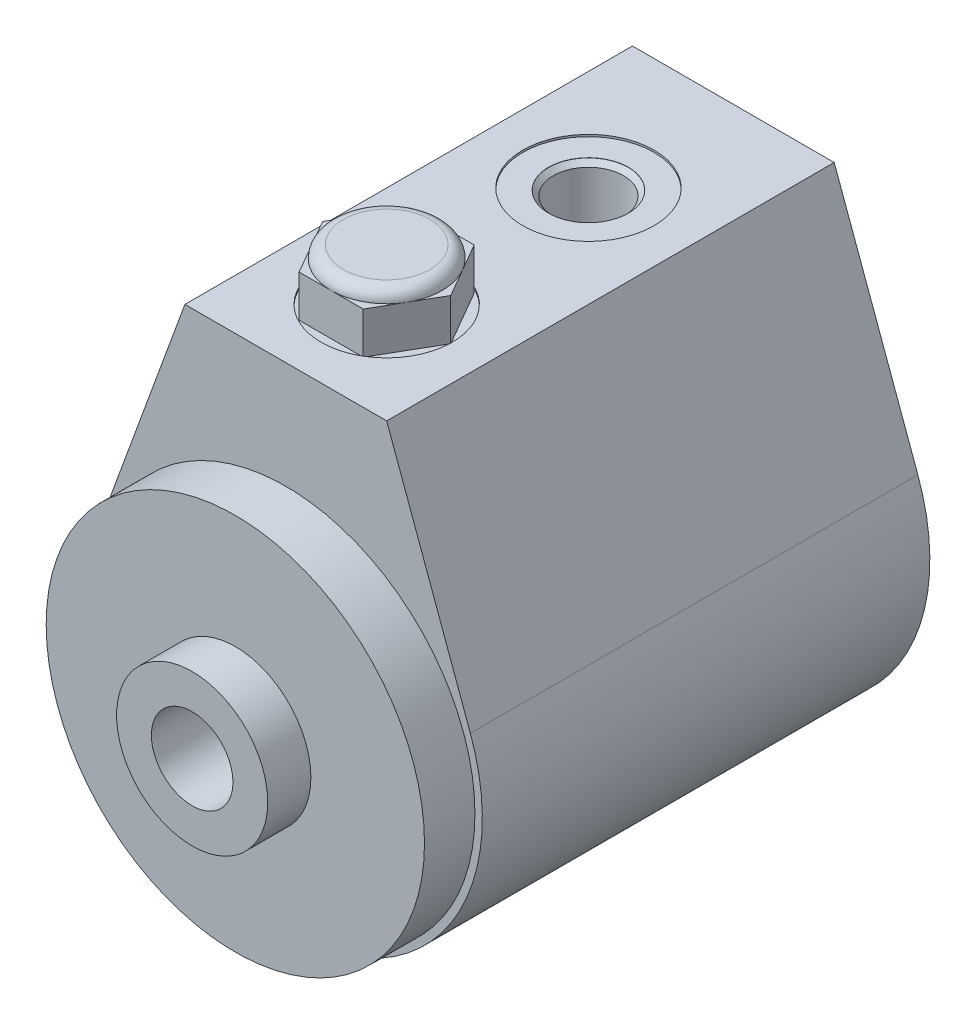
ISO-10303-21;
HEADER;
FILE_DESCRIPTION(('STEP AP214'),'2;1');
FILE_NAME('part.step','',(''),(''),'','','');
FILE_SCHEMA(('AUTOMOTIVE_DESIGN { 1 0 10303 214 1 1 1 1 }'));
ENDSEC;
DATA;
#1=APPLICATION_CONTEXT('core data for automotive mechanical design processes');
#2=APPLICATION_PROTOCOL_DEFINITION('international standard','automotive_design',2000,#1);
#3=PRODUCT_CONTEXT('',#1,'mechanical');
#4=PRODUCT('Part','Part','',(#3));
#5=PRODUCT_RELATED_PRODUCT_CATEGORY('part','',(#4));
#6=PRODUCT_DEFINITION_FORMATION('','',#4);
#7=PRODUCT_DEFINITION_CONTEXT('part definition',#1,'design');
#8=PRODUCT_DEFINITION('design','',#6,#7);
#9=PRODUCT_DEFINITION_SHAPE('','',#8);
#10=(LENGTH_UNIT() NAMED_UNIT(*) SI_UNIT(.MILLI.,.METRE.));
#11=(NAMED_UNIT(*) PLANE_ANGLE_UNIT() SI_UNIT($,.RADIAN.));
#12=(NAMED_UNIT(*) SI_UNIT($,.STERADIAN.) SOLID_ANGLE_UNIT());
#13=UNCERTAINTY_MEASURE_WITH_UNIT(LENGTH_MEASURE(1.E-05),#10,'distance_accuracy_value','');
#14=(GEOMETRIC_REPRESENTATION_CONTEXT(3) GLOBAL_UNCERTAINTY_ASSIGNED_CONTEXT((#13)) GLOBAL_UNIT_ASSIGNED_CONTEXT((#10,
#11,#12)) REPRESENTATION_CONTEXT('',''));
#15=CARTESIAN_POINT('',(0.,0.,0.));
#16=DIRECTION('',(0.,0.,1.));
#17=DIRECTION('',(1.,0.,0.));
#18=AXIS2_PLACEMENT_3D('',#15,#16,#17);
#19=CARTESIAN_POINT('',(4.0327916302895,43.8132,50.6221999999998));
#20=DIRECTION('',(-0.866025403784438,0.,-0.5));
#21=DIRECTION('',(-0.5,0.,0.866025403784438));
#22=AXIS2_PLACEMENT_3D('',#19,#20,#21);
#23=PLANE('',#22);
#24=DIRECTION('',(0.5,0.,-0.866025403784438));
#25=VECTOR('',#24,1.);
#26=CARTESIAN_POINT('',(4.0327916302895,42.2892,50.6221999999998));
#27=LINE('',#26,#25);
#28=CARTESIAN_POINT('',(4.0327916302895,42.2892,50.6221999999998));
#29=VERTEX_POINT('',#28);
#30=CARTESIAN_POINT('',(6.0491874454342,42.2892,47.1296999999999));
#31=VERTEX_POINT('',#30);
#32=EDGE_CURVE('E182',#29,#31,#27,.T.);
#33=ORIENTED_EDGE('',*,*,#32,.F.);
#34=DIRECTION('',(0.,-1.,0.));
#35=VECTOR('',#34,1.);
#36=CARTESIAN_POINT('',(4.0327916302895,43.8132,50.6221999999998));
#37=LINE('',#36,#35);
#38=CARTESIAN_POINT('',(4.0327916302895,37.0332,50.6221999999998));
#39=VERTEX_POINT('',#38);
#40=EDGE_CURVE('E198',#29,#39,#37,.T.);
#41=ORIENTED_EDGE('',*,*,#40,.T.);
#42=DIRECTION('',(0.5,0.,-0.866025403784438));
#43=VECTOR('',#42,1.);
#44=CARTESIAN_POINT('',(4.0327916302895,37.0332,50.6221999999998));
#45=LINE('',#44,#43);
#46=CARTESIAN_POINT('',(8.065583260579,37.0332,43.6371999999999));
#47=VERTEX_POINT('',#46);
#48=EDGE_CURVE('E183',#39,#47,#45,.T.);
#49=ORIENTED_EDGE('',*,*,#48,.T.);
#50=DIRECTION('',(0.,-1.,0.));
#51=VECTOR('',#50,1.);
#52=CARTESIAN_POINT('',(8.065583260579,43.8132,43.6371999999999));
#53=LINE('',#52,#51);
#54=CARTESIAN_POINT('',(8.065583260579,42.2892,43.6371999999999));
#55=VERTEX_POINT('',#54);
#56=EDGE_CURVE('E207',#55,#47,#53,.T.);
#57=ORIENTED_EDGE('',*,*,#56,.F.);
#58=EDGE_CURVE('E180',#31,#55,#27,.T.);
#59=ORIENTED_EDGE('',*,*,#58,.F.);
#60=EDGE_LOOP('',(#33,#41,#49,#57,#59));
#61=FACE_BOUND('',#60,.T.);
#62=ADVANCED_FACE('F42',(#61),#23,.F.);
#63=CARTESIAN_POINT('',(8.065583260579,43.8132,43.6371999999999));
#64=DIRECTION('',(-0.866025403784439,0.,0.5));
#65=DIRECTION('',(0.5,0.,0.866025403784439));
#66=AXIS2_PLACEMENT_3D('',#63,#64,#65);
#67=PLANE('',#66);
#68=DIRECTION('',(-0.5,0.,-0.866025403784439));
#69=VECTOR('',#68,1.);
#70=CARTESIAN_POINT('',(8.065583260579,42.2892,43.6371999999999));
#71=LINE('',#70,#69);
#72=CARTESIAN_POINT('',(6.0491874454343,42.2892,40.1447));
#73=VERTEX_POINT('',#72);
#74=EDGE_CURVE('E179',#55,#73,#71,.T.);
#75=ORIENTED_EDGE('',*,*,#74,.F.);
#76=ORIENTED_EDGE('',*,*,#56,.T.);
#77=DIRECTION('',(-0.5,0.,-0.866025403784439));
#78=VECTOR('',#77,1.);
#79=CARTESIAN_POINT('',(8.065583260579,37.0332,43.6371999999999));
#80=LINE('',#79,#78);
#81=CARTESIAN_POINT('',(4.03279163028937,37.0332,36.6521999999997));
#82=VERTEX_POINT('',#81);
#83=EDGE_CURVE('E186',#47,#82,#80,.T.);
#84=ORIENTED_EDGE('',*,*,#83,.T.);
#85=DIRECTION('',(0.,-1.,0.));
#86=VECTOR('',#85,1.);
#87=CARTESIAN_POINT('',(4.03279163028937,43.8132,36.6521999999997));
#88=LINE('',#87,#86);
#89=CARTESIAN_POINT('',(4.03279163028937,42.2892,36.6521999999997));
#90=VERTEX_POINT('',#89);
#91=EDGE_CURVE('E205',#90,#82,#88,.T.);
#92=ORIENTED_EDGE('',*,*,#91,.F.);
#93=EDGE_CURVE('E148',#73,#90,#71,.T.);
#94=ORIENTED_EDGE('',*,*,#93,.F.);
#95=EDGE_LOOP('',(#75,#76,#84,#92,#94));
#96=FACE_BOUND('',#95,.T.);
#97=ADVANCED_FACE('F343',(#96),#67,.F.);
#98=CARTESIAN_POINT('',(4.03279163028937,43.8132,36.6521999999997));
#99=DIRECTION('',(0.,0.,1.));
#100=DIRECTION('',(1.,0.,0.));
#101=AXIS2_PLACEMENT_3D('',#98,#99,#100);
#102=PLANE('',#101);
#103=DIRECTION('',(-1.,0.,0.));
#104=VECTOR('',#103,1.);
#105=CARTESIAN_POINT('',(4.03279163028937,42.2892,36.6521999999997));
#106=LINE('',#105,#104);
#107=CARTESIAN_POINT('',(0.,42.2892,36.6521999999997));
#108=VERTEX_POINT('',#107);
#109=EDGE_CURVE('E142',#90,#108,#106,.T.);
#110=ORIENTED_EDGE('',*,*,#109,.F.);
#111=ORIENTED_EDGE('',*,*,#91,.T.);
#112=DIRECTION('',(-1.,0.,0.));
#113=VECTOR('',#112,1.);
#114=CARTESIAN_POINT('',(4.03279163028937,37.0332,36.6521999999997));
#115=LINE('',#114,#113);
#116=CARTESIAN_POINT('',(-4.03279163028957,37.0332,36.6521999999997));
#117=VERTEX_POINT('',#116);
#118=EDGE_CURVE('E189',#82,#117,#115,.T.);
#119=ORIENTED_EDGE('',*,*,#118,.T.);
#120=DIRECTION('',(0.,-1.,0.));
#121=VECTOR('',#120,1.);
#122=CARTESIAN_POINT('',(-4.03279163028957,43.8132,36.6521999999997));
#123=LINE('',#122,#121);
#124=CARTESIAN_POINT('',(-4.03279163028957,42.2892,36.6521999999997));
#125=VERTEX_POINT('',#124);
#126=EDGE_CURVE('E173',#125,#117,#123,.T.);
#127=ORIENTED_EDGE('',*,*,#126,.F.);
#128=EDGE_CURVE('E152',#108,#125,#106,.T.);
#129=ORIENTED_EDGE('',*,*,#128,.F.);
#130=EDGE_LOOP('',(#110,#111,#119,#127,#129));
#131=FACE_BOUND('',#130,.T.);
#132=ADVANCED_FACE('F171',(#131),#102,.F.);
#133=CARTESIAN_POINT('',(-4.03279163028957,43.8132,36.6521999999997));
#134=DIRECTION('',(0.866025403784439,0.,0.5));
#135=DIRECTION('',(0.5,0.,-0.866025403784439));
#136=AXIS2_PLACEMENT_3D('',#133,#134,#135);
#137=PLANE('',#136);
#138=DIRECTION('',(-0.5,0.,0.866025403784439));
#139=VECTOR('',#138,1.);
#140=CARTESIAN_POINT('',(-4.03279163028957,42.2892,36.6521999999997));
#141=LINE('',#140,#139);
#142=CARTESIAN_POINT('',(-6.04918744543446,42.2892,40.1446999999999));
#143=VERTEX_POINT('',#142);
#144=EDGE_CURVE('E159',#125,#143,#141,.T.);
#145=ORIENTED_EDGE('',*,*,#144,.F.);
#146=ORIENTED_EDGE('',*,*,#126,.T.);
#147=DIRECTION('',(-0.5,0.,0.866025403784439));
#148=VECTOR('',#147,1.);
#149=CARTESIAN_POINT('',(-4.03279163028957,37.0332,36.6521999999997));
#150=LINE('',#149,#148);
#151=CARTESIAN_POINT('',(-8.06558326057918,37.0332,43.6371999999998));
#152=VERTEX_POINT('',#151);
#153=EDGE_CURVE('E191',#117,#152,#150,.T.);
#154=ORIENTED_EDGE('',*,*,#153,.T.);
#155=DIRECTION('',(0.,-1.,0.));
#156=VECTOR('',#155,1.);
#157=CARTESIAN_POINT('',(-8.06558326057918,43.8132,43.6371999999998));
#158=LINE('',#157,#156);
#159=CARTESIAN_POINT('',(-8.06558326057918,42.2892,43.6371999999998));
#160=VERTEX_POINT('',#159);
#161=EDGE_CURVE('E202',#160,#152,#158,.T.);
#162=ORIENTED_EDGE('',*,*,#161,.F.);
#163=EDGE_CURVE('E174',#143,#160,#141,.T.);
#164=ORIENTED_EDGE('',*,*,#163,.F.);
#165=EDGE_LOOP('',(#145,#146,#154,#162,#164));
#166=FACE_BOUND('',#165,.T.);
#167=ADVANCED_FACE('F363',(#166),#137,.F.);
#168=CARTESIAN_POINT('',(-8.06558326057918,43.8132,43.6371999999998));
#169=DIRECTION('',(0.866025403784439,0.,-0.5));
#170=DIRECTION('',(-0.5,0.,-0.866025403784439));
#171=AXIS2_PLACEMENT_3D('',#168,#169,#170);
#172=PLANE('',#171);
#173=DIRECTION('',(0.5,0.,0.866025403784439));
#174=VECTOR('',#173,1.);
#175=CARTESIAN_POINT('',(-8.06558326057918,42.2892,43.6371999999998));
#176=LINE('',#175,#174);
#177=CARTESIAN_POINT('',(-6.04918744543431,42.2892,47.1297));
#178=VERTEX_POINT('',#177);
#179=EDGE_CURVE('E351',#160,#178,#176,.T.);
#180=ORIENTED_EDGE('',*,*,#179,.F.);
#181=ORIENTED_EDGE('',*,*,#161,.T.);
#182=DIRECTION('',(0.5,0.,0.866025403784439));
#183=VECTOR('',#182,1.);
#184=CARTESIAN_POINT('',(-8.06558326057918,37.0332,43.6371999999998));
#185=LINE('',#184,#183);
#186=CARTESIAN_POINT('',(-4.03279163028966,37.0332,50.6221999999998));
#187=VERTEX_POINT('',#186);
#188=EDGE_CURVE('E194',#152,#187,#185,.T.);
#189=ORIENTED_EDGE('',*,*,#188,.T.);
#190=DIRECTION('',(0.,-1.,0.));
#191=VECTOR('',#190,1.);
#192=CARTESIAN_POINT('',(-4.03279163028966,43.8132,50.6221999999998));
#193=LINE('',#192,#191);
#194=CARTESIAN_POINT('',(-4.03279163028966,42.2892,50.6221999999998));
#195=VERTEX_POINT('',#194);
#196=EDGE_CURVE('E67',#195,#187,#193,.T.);
#197=ORIENTED_EDGE('',*,*,#196,.F.);
#198=EDGE_CURVE('E349',#178,#195,#176,.T.);
#199=ORIENTED_EDGE('',*,*,#198,.F.);
#200=EDGE_LOOP('',(#180,#181,#189,#197,#199));
#201=FACE_BOUND('',#200,.T.);
#202=ADVANCED_FACE('F362',(#201),#172,.F.);
#203=CARTESIAN_POINT('',(-4.03279163028966,43.8132,50.6221999999998));
#204=DIRECTION('',(0.,0.,-1.));
#205=DIRECTION('',(-1.,0.,0.));
#206=AXIS2_PLACEMENT_3D('',#203,#204,#205);
#207=PLANE('',#206);
#208=DIRECTION('',(1.,0.,0.));
#209=VECTOR('',#208,1.);
#210=CARTESIAN_POINT('',(-4.03279163028966,42.2892,50.6221999999998));
#211=LINE('',#210,#209);
#212=CARTESIAN_POINT('',(0.,42.2892,50.6221999999998));
#213=VERTEX_POINT('',#212);
#214=EDGE_CURVE('E11',#195,#213,#211,.T.);
#215=ORIENTED_EDGE('',*,*,#214,.F.);
#216=ORIENTED_EDGE('',*,*,#196,.T.);
#217=DIRECTION('',(1.,0.,0.));
#218=VECTOR('',#217,1.);
#219=CARTESIAN_POINT('',(-4.03279163028966,37.0332,50.6221999999998));
#220=LINE('',#219,#218);
#221=EDGE_CURVE('E196',#187,#39,#220,.T.);
#222=ORIENTED_EDGE('',*,*,#221,.T.);
#223=ORIENTED_EDGE('',*,*,#40,.F.);
#224=EDGE_CURVE('E46',#213,#29,#211,.T.);
#225=ORIENTED_EDGE('',*,*,#224,.F.);
#226=EDGE_LOOP('',(#215,#216,#222,#223,#225));
#227=FACE_BOUND('',#226,.T.);
#228=ADVANCED_FACE('F333',(#227),#207,.F.);
#229=CARTESIAN_POINT('',(-8.255,37.0332,43.6372));
#230=DIRECTION('',(0.,1.,0.));
#231=DIRECTION('',(0.,0.,1.));
#232=AXIS2_PLACEMENT_3D('',#229,#230,#231);
#233=PLANE('',#232);
#234=CARTESIAN_POINT('',(0.,37.0332,43.6372));
#235=DIRECTION('',(0.,-1.,0.));
#236=DIRECTION('',(0.,0.,-1.));
#237=AXIS2_PLACEMENT_3D('',#234,#235,#236);
#238=CIRCLE('',#237,8.255);
#239=CARTESIAN_POINT('',(0.,37.0332,35.3822));
#240=VERTEX_POINT('',#239);
#241=EDGE_CURVE('E218',#240,#240,#238,.T.);
#242=ORIENTED_EDGE('',*,*,#241,.F.);
#243=EDGE_LOOP('',(#242));
#244=FACE_BOUND('',#243,.T.);
#245=ORIENTED_EDGE('',*,*,#83,.F.);
#246=ORIENTED_EDGE('',*,*,#48,.F.);
#247=ORIENTED_EDGE('',*,*,#221,.F.);
#248=ORIENTED_EDGE('',*,*,#188,.F.);
#249=ORIENTED_EDGE('',*,*,#153,.F.);
#250=ORIENTED_EDGE('',*,*,#118,.F.);
#251=EDGE_LOOP('',(#245,#246,#247,#248,#249,#250));
#252=FACE_BOUND('',#251,.T.);
#253=ADVANCED_FACE('F339',(#244,#252),#233,.T.);
#254=CARTESIAN_POINT('',(12.7,37.2872,0.));
#255=DIRECTION('',(0.,1.,0.));
#256=DIRECTION('',(0.,0.,1.));
#257=AXIS2_PLACEMENT_3D('',#254,#255,#256);
#258=PLANE('',#257);
#259=CARTESIAN_POINT('',(0.,37.2872,18.2372));
#260=DIRECTION('',(0.,-1.,0.));
#261=DIRECTION('',(0.,0.,-1.));
#262=AXIS2_PLACEMENT_3D('',#259,#260,#261);
#263=CIRCLE('',#262,8.255);
#264=CARTESIAN_POINT('',(0.,37.2872,9.9822));
#265=VERTEX_POINT('',#264);
#266=EDGE_CURVE('E263',#265,#265,#263,.T.);
#267=ORIENTED_EDGE('',*,*,#266,.T.);
#268=EDGE_LOOP('',(#267));
#269=FACE_BOUND('',#268,.T.);
#270=DIRECTION('',(-1.,0.,0.));
#271=VECTOR('',#270,1.);
#272=CARTESIAN_POINT('',(12.7,37.2872,56.3372));
#273=LINE('',#272,#271);
#274=CARTESIAN_POINT('',(12.7,37.2872,56.3372));
#275=VERTEX_POINT('',#274);
#276=CARTESIAN_POINT('',(-12.7,37.2872,56.3372));
#277=VERTEX_POINT('',#276);
#278=EDGE_CURVE('E310',#275,#277,#273,.T.);
#279=ORIENTED_EDGE('',*,*,#278,.F.);
#280=DIRECTION('',(0.,0.,1.));
#281=VECTOR('',#280,1.);
#282=CARTESIAN_POINT('',(12.7,37.2872,0.));
#283=LINE('',#282,#281);
#284=CARTESIAN_POINT('',(12.7,37.2872,0.));
#285=VERTEX_POINT('',#284);
#286=EDGE_CURVE('E321',#285,#275,#283,.T.);
#287=ORIENTED_EDGE('',*,*,#286,.F.);
#288=DIRECTION('',(-1.,0.,0.));
#289=VECTOR('',#288,1.);
#290=CARTESIAN_POINT('',(12.7,37.2872,0.));
#291=LINE('',#290,#289);
#292=CARTESIAN_POINT('',(-12.7,37.2872,0.));
#293=VERTEX_POINT('',#292);
#294=EDGE_CURVE('E298',#285,#293,#291,.T.);
#295=ORIENTED_EDGE('',*,*,#294,.T.);
#296=DIRECTION('',(0.,0.,1.));
#297=VECTOR('',#296,1.);
#298=CARTESIAN_POINT('',(-12.7,37.2872,0.));
#299=LINE('',#298,#297);
#300=EDGE_CURVE('E318',#293,#277,#299,.T.);
#301=ORIENTED_EDGE('',*,*,#300,.T.);
#302=EDGE_LOOP('',(#279,#287,#295,#301));
#303=FACE_BOUND('',#302,.T.);
#304=CARTESIAN_POINT('',(0.,37.2872,43.6372));
#305=DIRECTION('',(0.,-1.,0.));
#306=DIRECTION('',(0.,0.,-1.));
#307=AXIS2_PLACEMENT_3D('',#304,#305,#306);
#308=CIRCLE('',#307,8.255);
#309=CARTESIAN_POINT('',(0.,37.2872,35.3822));
#310=VERTEX_POINT('',#309);
#311=EDGE_CURVE('E221',#310,#310,#308,.T.);
#312=ORIENTED_EDGE('',*,*,#311,.T.);
#313=EDGE_LOOP('',(#312));
#314=FACE_BOUND('',#313,.T.);
#315=ADVANCED_FACE('F392',(#269,#303,#314),#258,.T.);
#316=CARTESIAN_POINT('',(0.,0.,5.4102));
#317=DIRECTION('',(0.,0.,1.));
#318=DIRECTION('',(1.,0.,0.));
#319=AXIS2_PLACEMENT_3D('',#316,#317,#318);
#320=PLANE('',#319);
#321=CARTESIAN_POINT('',(0.,0.,5.41020000000001));
#322=DIRECTION('',(0.,0.,1.));
#323=DIRECTION('',(1.,0.,0.));
#324=AXIS2_PLACEMENT_3D('',#321,#322,#323);
#325=CIRCLE('',#324,9.5123);
#326=CARTESIAN_POINT('',(9.5123,0.,5.41020000000001));
#327=VERTEX_POINT('',#326);
#328=EDGE_CURVE('E269',#327,#327,#325,.T.);
#329=ORIENTED_EDGE('',*,*,#328,.F.);
#330=EDGE_LOOP('',(#329));
#331=FACE_BOUND('',#330,.T.);
#332=CARTESIAN_POINT('',(0.,0.,5.4102));
#333=DIRECTION('',(0.,0.,-1.));
#334=DIRECTION('',(-1.,0.,0.));
#335=AXIS2_PLACEMENT_3D('',#332,#333,#334);
#336=CIRCLE('',#335,6.7437);
#337=CARTESIAN_POINT('',(-6.7437,0.,5.4102));
#338=VERTEX_POINT('',#337);
#339=EDGE_CURVE('E227',#338,#338,#336,.T.);
#340=ORIENTED_EDGE('',*,*,#339,.F.);
#341=EDGE_LOOP('',(#340));
#342=FACE_BOUND('',#341,.T.);
#343=ADVANCED_FACE('F459',(#331,#342),#320,.F.);
#344=CARTESIAN_POINT('',(0.,0.,6.35));
#345=DIRECTION('',(0.,0.,1.));
#346=DIRECTION('',(1.,0.,0.));
#347=AXIS2_PLACEMENT_3D('',#344,#345,#346);
#348=PLANE('',#347);
#349=CARTESIAN_POINT('',(0.,0.,6.35));
#350=DIRECTION('',(0.,0.,-1.));
#351=DIRECTION('',(-1.,0.,0.));
#352=AXIS2_PLACEMENT_3D('',#349,#350,#351);
#353=CIRCLE('',#352,11.938);
#354=CARTESIAN_POINT('',(-11.938,0.,6.35));
#355=VERTEX_POINT('',#354);
#356=EDGE_CURVE('E287',#355,#355,#353,.T.);
#357=ORIENTED_EDGE('',*,*,#356,.T.);
#358=EDGE_LOOP('',(#357));
#359=FACE_BOUND('',#358,.T.);
#360=CARTESIAN_POINT('',(0.,0.,6.35));
#361=DIRECTION('',(0.,0.,1.));
#362=DIRECTION('',(1.,0.,0.));
#363=AXIS2_PLACEMENT_3D('',#360,#361,#362);
#364=CIRCLE('',#363,9.5123);
#365=CARTESIAN_POINT('',(9.5123,0.,6.35));
#366=VERTEX_POINT('',#365);
#367=EDGE_CURVE('E317',#366,#366,#364,.F.);
#368=ORIENTED_EDGE('',*,*,#367,.F.);
#369=EDGE_LOOP('',(#368));
#370=FACE_BOUND('',#369,.T.);
#371=ADVANCED_FACE('F462',(#359,#370),#348,.F.);
#372=CARTESIAN_POINT('',(0.,0.,56.3372));
#373=DIRECTION('',(0.,0.,1.));
#374=DIRECTION('',(1.,0.,0.));
#375=AXIS2_PLACEMENT_3D('',#372,#373,#374);
#376=PLANE('',#375);
#377=CARTESIAN_POINT('',(0.,0.,56.3372));
#378=DIRECTION('',(0.,0.,1.));
#379=DIRECTION('',(1.,0.,0.));
#380=AXIS2_PLACEMENT_3D('',#377,#378,#379);
#381=CIRCLE('',#380,24.7396);
#382=CARTESIAN_POINT('',(-23.2330948392539,8.5012418122432,56.3372));
#383=VERTEX_POINT('',#382);
#384=CARTESIAN_POINT('',(23.2330948392539,8.5012418122432,56.3372));
#385=VERTEX_POINT('',#384);
#386=EDGE_CURVE('E290',#383,#385,#381,.T.);
#387=ORIENTED_EDGE('',*,*,#386,.T.);
#388=DIRECTION('',(-0.34362891122909,0.93910551663139,0.));
#389=VECTOR('',#388,1.);
#390=CARTESIAN_POINT('',(23.2330948392539,8.5012418122432,56.3372));
#391=LINE('',#390,#389);
#392=EDGE_CURVE('E307',#385,#275,#391,.T.);
#393=ORIENTED_EDGE('',*,*,#392,.T.);
#394=ORIENTED_EDGE('',*,*,#278,.T.);
#395=DIRECTION('',(-0.34362891122909,-0.93910551663139,0.));
#396=VECTOR('',#395,1.);
#397=CARTESIAN_POINT('',(-12.7,37.2872,56.3372));
#398=LINE('',#397,#396);
#399=EDGE_CURVE('E295',#277,#383,#398,.T.);
#400=ORIENTED_EDGE('',*,*,#399,.T.);
#401=EDGE_LOOP('',(#387,#393,#394,#400));
#402=FACE_BOUND('',#401,.T.);
#403=CARTESIAN_POINT('',(0.,0.,56.3372));
#404=DIRECTION('',(0.,0.,1.));
#405=DIRECTION('',(1.,0.,0.));
#406=AXIS2_PLACEMENT_3D('',#403,#404,#405);
#407=CIRCLE('',#406,23.8125);
#408=CARTESIAN_POINT('',(23.8125,0.,56.3372));
#409=VERTEX_POINT('',#408);
#410=EDGE_CURVE('E278',#409,#409,#407,.T.);
#411=ORIENTED_EDGE('',*,*,#410,.F.);
#412=EDGE_LOOP('',(#411));
#413=FACE_BOUND('',#412,.T.);
#414=ADVANCED_FACE('F489',(#402,#413),#376,.T.);
#415=CARTESIAN_POINT('',(0.,0.,0.));
#416=DIRECTION('',(0.,0.,1.));
#417=DIRECTION('',(1.,0.,0.));
#418=AXIS2_PLACEMENT_3D('',#415,#416,#417);
#419=CYLINDRICAL_SURFACE('',#418,24.7396);
#420=ORIENTED_EDGE('',*,*,#386,.F.);
#421=DIRECTION('',(0.,0.,1.));
#422=VECTOR('',#421,1.);
#423=CARTESIAN_POINT('',(-23.2330948392539,8.5012418122432,0.));
#424=LINE('',#423,#422);
#425=CARTESIAN_POINT('',(-23.2330948392539,8.5012418122432,0.));
#426=VERTEX_POINT('',#425);
#427=EDGE_CURVE('E315',#426,#383,#424,.T.);
#428=ORIENTED_EDGE('',*,*,#427,.F.);
#429=CARTESIAN_POINT('',(0.,0.,0.));
#430=DIRECTION('',(0.,0.,1.));
#431=DIRECTION('',(1.,0.,0.));
#432=AXIS2_PLACEMENT_3D('',#429,#430,#431);
#433=CIRCLE('',#432,24.7396);
#434=CARTESIAN_POINT('',(23.2330948392539,8.5012418122432,0.));
#435=VERTEX_POINT('',#434);
#436=EDGE_CURVE('E291',#426,#435,#433,.T.);
#437=ORIENTED_EDGE('',*,*,#436,.T.);
#438=DIRECTION('',(0.,0.,1.));
#439=VECTOR('',#438,1.);
#440=CARTESIAN_POINT('',(23.2330948392539,8.5012418122432,0.));
#441=LINE('',#440,#439);
#442=EDGE_CURVE('E304',#435,#385,#441,.T.);
#443=ORIENTED_EDGE('',*,*,#442,.T.);
#444=EDGE_LOOP('',(#420,#428,#437,#443));
#445=FACE_BOUND('',#444,.T.);
#446=ADVANCED_FACE('F44',(#445),#419,.T.);
#447=CARTESIAN_POINT('',(-12.7,37.2872,0.));
#448=DIRECTION('',(-0.93910551663139,0.34362891122909,0.));
#449=DIRECTION('',(-0.34362891122909,-0.93910551663139,0.));
#450=AXIS2_PLACEMENT_3D('',#447,#448,#449);
#451=PLANE('',#450);
#452=ORIENTED_EDGE('',*,*,#399,.F.);
#453=ORIENTED_EDGE('',*,*,#300,.F.);
#454=DIRECTION('',(-0.34362891122909,-0.93910551663139,0.));
#455=VECTOR('',#454,1.);
#456=CARTESIAN_POINT('',(-12.7,37.2872,0.));
#457=LINE('',#456,#455);
#458=EDGE_CURVE('E301',#293,#426,#457,.T.);
#459=ORIENTED_EDGE('',*,*,#458,.T.);
#460=ORIENTED_EDGE('',*,*,#427,.T.);
#461=EDGE_LOOP('',(#452,#453,#459,#460));
#462=FACE_BOUND('',#461,.T.);
#463=ADVANCED_FACE('F498',(#462),#451,.T.);
#464=CARTESIAN_POINT('',(23.2330948392539,8.5012418122432,0.));
#465=DIRECTION('',(0.93910551663139,0.34362891122909,0.));
#466=DIRECTION('',(-0.34362891122909,0.93910551663139,0.));
#467=AXIS2_PLACEMENT_3D('',#464,#465,#466);
#468=PLANE('',#467);
#469=ORIENTED_EDGE('',*,*,#392,.F.);
#470=ORIENTED_EDGE('',*,*,#442,.F.);
#471=DIRECTION('',(-0.34362891122909,0.93910551663139,0.));
#472=VECTOR('',#471,1.);
#473=CARTESIAN_POINT('',(23.2330948392539,8.5012418122432,0.));
#474=LINE('',#473,#472);
#475=EDGE_CURVE('E294',#435,#285,#474,.T.);
#476=ORIENTED_EDGE('',*,*,#475,.T.);
#477=ORIENTED_EDGE('',*,*,#286,.T.);
#478=EDGE_LOOP('',(#469,#470,#476,#477));
#479=FACE_BOUND('',#478,.T.);
#480=ADVANCED_FACE('F493',(#479),#468,.T.);
#481=CARTESIAN_POINT('',(0.,0.,0.));
#482=DIRECTION('',(0.,0.,1.));
#483=DIRECTION('',(1.,0.,0.));
#484=AXIS2_PLACEMENT_3D('',#481,#482,#483);
#485=PLANE('',#484);
#486=CARTESIAN_POINT('',(-18.0086,-1.25753454513749E-13,0.));
#487=DIRECTION('',(0.,0.,-1.));
#488=DIRECTION('',(-1.,0.,0.));
#489=AXIS2_PLACEMENT_3D('',#486,#487,#488);
#490=CIRCLE('',#489,3.39090000000001);
#491=CARTESIAN_POINT('',(-21.3995,-1.25753454513749E-13,0.));
#492=VERTEX_POINT('',#491);
#493=EDGE_CURVE('E239',#492,#492,#490,.T.);
#494=ORIENTED_EDGE('',*,*,#493,.F.);
#495=EDGE_LOOP('',(#494));
#496=FACE_BOUND('',#495,.T.);
#497=CARTESIAN_POINT('',(18.0086,0.,0.));
#498=DIRECTION('',(0.,0.,-1.));
#499=DIRECTION('',(-1.,0.,0.));
#500=AXIS2_PLACEMENT_3D('',#497,#498,#499);
#501=CIRCLE('',#500,3.39090000000001);
#502=CARTESIAN_POINT('',(14.6177,0.,0.));
#503=VERTEX_POINT('',#502);
#504=EDGE_CURVE('E245',#503,#503,#501,.T.);
#505=ORIENTED_EDGE('',*,*,#504,.F.);
#506=EDGE_LOOP('',(#505));
#507=FACE_BOUND('',#506,.T.);
#508=CARTESIAN_POINT('',(0.,0.,0.));
#509=DIRECTION('',(0.,0.,-1.));
#510=DIRECTION('',(-1.,0.,0.));
#511=AXIS2_PLACEMENT_3D('',#508,#509,#510);
#512=CIRCLE('',#511,11.938);
#513=CARTESIAN_POINT('',(-11.938,0.,0.));
#514=VERTEX_POINT('',#513);
#515=EDGE_CURVE('E284',#514,#514,#512,.T.);
#516=ORIENTED_EDGE('',*,*,#515,.F.);
#517=EDGE_LOOP('',(#516));
#518=FACE_BOUND('',#517,.T.);
#519=ORIENTED_EDGE('',*,*,#436,.F.);
#520=ORIENTED_EDGE('',*,*,#458,.F.);
#521=ORIENTED_EDGE('',*,*,#294,.F.);
#522=ORIENTED_EDGE('',*,*,#475,.F.);
#523=EDGE_LOOP('',(#519,#520,#521,#522));
#524=FACE_BOUND('',#523,.T.);
#525=ADVANCED_FACE('F485',(#496,#507,#518,#524),#485,.F.);
#526=CARTESIAN_POINT('',(0.,0.,0.));
#527=DIRECTION('',(0.,0.,-1.));
#528=DIRECTION('',(-1.,0.,0.));
#529=AXIS2_PLACEMENT_3D('',#526,#527,#528);
#530=CYLINDRICAL_SURFACE('',#529,11.938);
#531=ORIENTED_EDGE('',*,*,#356,.F.);
#532=EDGE_LOOP('',(#531));
#533=FACE_BOUND('',#532,.T.);
#534=ORIENTED_EDGE('',*,*,#515,.T.);
#535=EDGE_LOOP('',(#534));
#536=FACE_BOUND('',#535,.T.);
#537=ADVANCED_FACE('F481',(#533,#536),#530,.F.);
#538=CARTESIAN_POINT('',(0.,0.,0.));
#539=DIRECTION('',(0.,0.,1.));
#540=DIRECTION('',(1.,0.,0.));
#541=AXIS2_PLACEMENT_3D('',#538,#539,#540);
#542=CYLINDRICAL_SURFACE('',#541,9.5123);
#543=CARTESIAN_POINT('',(0.,0.,68.1228));
#544=DIRECTION('',(0.,0.,1.));
#545=DIRECTION('',(1.,0.,0.));
#546=AXIS2_PLACEMENT_3D('',#543,#544,#545);
#547=CIRCLE('',#546,9.5123);
#548=CARTESIAN_POINT('',(9.5123,0.,68.1228));
#549=VERTEX_POINT('',#548);
#550=EDGE_CURVE('E281',#549,#549,#547,.T.);
#551=ORIENTED_EDGE('',*,*,#550,.F.);
#552=EDGE_LOOP('',(#551));
#553=FACE_BOUND('',#552,.T.);
#554=CARTESIAN_POINT('',(0.,0.,62.6872));
#555=DIRECTION('',(0.,0.,1.));
#556=DIRECTION('',(1.,0.,0.));
#557=AXIS2_PLACEMENT_3D('',#554,#555,#556);
#558=CIRCLE('',#557,9.5123);
#559=CARTESIAN_POINT('',(9.5123,0.,62.6872));
#560=VERTEX_POINT('',#559);
#561=EDGE_CURVE('E272',#560,#560,#558,.T.);
#562=ORIENTED_EDGE('',*,*,#561,.T.);
#563=EDGE_LOOP('',(#562));
#564=FACE_BOUND('',#563,.T.);
#565=ADVANCED_FACE('F477',(#553,#564),#542,.T.);
#566=CARTESIAN_POINT('',(9.5123,0.,68.1228));
#567=DIRECTION('',(0.,0.,-1.));
#568=DIRECTION('',(-1.,0.,0.));
#569=AXIS2_PLACEMENT_3D('',#566,#567,#568);
#570=PLANE('',#569);
#571=CARTESIAN_POINT('',(0.,0.,68.1228));
#572=DIRECTION('',(0.,0.,-1.));
#573=DIRECTION('',(-1.,0.,0.));
#574=AXIS2_PLACEMENT_3D('',#571,#572,#573);
#575=CIRCLE('',#574,5.1308);
#576=CARTESIAN_POINT('',(-5.1308,0.,68.1228));
#577=VERTEX_POINT('',#576);
#578=EDGE_CURVE('E236',#577,#577,#575,.T.);
#579=ORIENTED_EDGE('',*,*,#578,.T.);
#580=EDGE_LOOP('',(#579));
#581=FACE_BOUND('',#580,.T.);
#582=ORIENTED_EDGE('',*,*,#550,.T.);
#583=EDGE_LOOP('',(#582));
#584=FACE_BOUND('',#583,.T.);
#585=ADVANCED_FACE('F473',(#581,#584),#570,.F.);
#586=CARTESIAN_POINT('',(0.,0.,0.));
#587=DIRECTION('',(0.,0.,1.));
#588=DIRECTION('',(1.,0.,0.));
#589=AXIS2_PLACEMENT_3D('',#586,#587,#588);
#590=CYLINDRICAL_SURFACE('',#589,23.8125);
#591=CARTESIAN_POINT('',(0.,0.,62.6872));
#592=DIRECTION('',(0.,0.,1.));
#593=DIRECTION('',(1.,0.,0.));
#594=AXIS2_PLACEMENT_3D('',#591,#592,#593);
#595=CIRCLE('',#594,23.8125);
#596=CARTESIAN_POINT('',(23.8125,0.,62.6872));
#597=VERTEX_POINT('',#596);
#598=EDGE_CURVE('E275',#597,#597,#595,.T.);
#599=ORIENTED_EDGE('',*,*,#598,.F.);
#600=EDGE_LOOP('',(#599));
#601=FACE_BOUND('',#600,.T.);
#602=ORIENTED_EDGE('',*,*,#410,.T.);
#603=EDGE_LOOP('',(#602));
#604=FACE_BOUND('',#603,.T.);
#605=ADVANCED_FACE('F469',(#601,#604),#590,.T.);
#606=CARTESIAN_POINT('',(23.8125,0.,62.6872));
#607=DIRECTION('',(0.,0.,-1.));
#608=DIRECTION('',(-1.,0.,0.));
#609=AXIS2_PLACEMENT_3D('',#606,#607,#608);
#610=PLANE('',#609);
#611=ORIENTED_EDGE('',*,*,#561,.F.);
#612=EDGE_LOOP('',(#611));
#613=FACE_BOUND('',#612,.T.);
#614=ORIENTED_EDGE('',*,*,#598,.T.);
#615=EDGE_LOOP('',(#614));
#616=FACE_BOUND('',#615,.T.);
#617=ADVANCED_FACE('F466',(#613,#616),#610,.F.);
#618=CARTESIAN_POINT('',(0.,0.,0.));
#619=DIRECTION('',(0.,0.,1.));
#620=DIRECTION('',(1.,0.,0.));
#621=AXIS2_PLACEMENT_3D('',#618,#619,#620);
#622=CYLINDRICAL_SURFACE('',#621,9.5123);
#623=ORIENTED_EDGE('',*,*,#367,.T.);
#624=EDGE_LOOP('',(#623));
#625=FACE_BOUND('',#624,.T.);
#626=ORIENTED_EDGE('',*,*,#328,.T.);
#627=EDGE_LOOP('',(#626));
#628=FACE_BOUND('',#627,.T.);
#629=ADVANCED_FACE('F457',(#625,#628),#622,.T.);
#630=CARTESIAN_POINT('',(0.,37.2872,18.2372));
#631=DIRECTION('',(0.,-1.,0.));
#632=DIRECTION('',(0.,0.,-1.));
#633=AXIS2_PLACEMENT_3D('',#630,#631,#632);
#634=CYLINDRICAL_SURFACE('',#633,4.4196);
#635=CARTESIAN_POINT('',(0.,21.7932,18.2372));
#636=DIRECTION('',(0.,-1.,0.));
#637=DIRECTION('',(0.,0.,-1.));
#638=AXIS2_PLACEMENT_3D('',#635,#636,#637);
#639=CIRCLE('',#638,4.4196);
#640=CARTESIAN_POINT('',(0.,21.7932,13.8176));
#641=VERTEX_POINT('',#640);
#642=EDGE_CURVE('E266',#641,#641,#639,.T.);
#643=ORIENTED_EDGE('',*,*,#642,.T.);
#644=EDGE_LOOP('',(#643));
#645=FACE_BOUND('',#644,.T.);
#646=CARTESIAN_POINT('',(0.,36.4109,18.2372));
#647=DIRECTION('',(0.,-1.,0.));
#648=DIRECTION('',(0.,0.,-1.));
#649=AXIS2_PLACEMENT_3D('',#646,#647,#648);
#650=CIRCLE('',#649,4.4196);
#651=CARTESIAN_POINT('',(0.,36.4109,13.8176));
#652=VERTEX_POINT('',#651);
#653=EDGE_CURVE('E251',#652,#652,#650,.T.);
#654=ORIENTED_EDGE('',*,*,#653,.F.);
#655=EDGE_LOOP('',(#654));
#656=FACE_BOUND('',#655,.T.);
#657=ADVANCED_FACE('F453',(#645,#656),#634,.F.);
#658=CARTESIAN_POINT('',(-4.4196,21.7932,18.2372));
#659=DIRECTION('',(0.,1.,0.));
#660=DIRECTION('',(0.,0.,1.));
#661=AXIS2_PLACEMENT_3D('',#658,#659,#660);
#662=PLANE('',#661);
#663=ORIENTED_EDGE('',*,*,#642,.F.);
#664=EDGE_LOOP('',(#663));
#665=FACE_BOUND('',#664,.T.);
#666=ADVANCED_FACE('F449',(#665),#662,.T.);
#667=CARTESIAN_POINT('',(0.,37.2872,18.2372));
#668=DIRECTION('',(0.,-1.,0.));
#669=DIRECTION('',(0.,0.,-1.));
#670=AXIS2_PLACEMENT_3D('',#667,#668,#669);
#671=CYLINDRICAL_SURFACE('',#670,8.255);
#672=CARTESIAN_POINT('',(0.,37.0332,18.2372));
#673=DIRECTION('',(0.,-1.,0.));
#674=DIRECTION('',(0.,0.,-1.));
#675=AXIS2_PLACEMENT_3D('',#672,#673,#674);
#676=CIRCLE('',#675,8.255);
#677=CARTESIAN_POINT('',(0.,37.0332,9.9822));
#678=VERTEX_POINT('',#677);
#679=EDGE_CURVE('E260',#678,#678,#676,.T.);
#680=ORIENTED_EDGE('',*,*,#679,.T.);
#681=EDGE_LOOP('',(#680));
#682=FACE_BOUND('',#681,.T.);
#683=ORIENTED_EDGE('',*,*,#266,.F.);
#684=EDGE_LOOP('',(#683));
#685=FACE_BOUND('',#684,.T.);
#686=ADVANCED_FACE('F445',(#682,#685),#671,.F.);
#687=CARTESIAN_POINT('',(-8.255,37.0332,18.2372));
#688=DIRECTION('',(0.,1.,0.));
#689=DIRECTION('',(0.,0.,1.));
#690=AXIS2_PLACEMENT_3D('',#687,#688,#689);
#691=PLANE('',#690);
#692=CARTESIAN_POINT('',(0.,37.0332,18.2372));
#693=DIRECTION('',(0.,-1.,0.));
#694=DIRECTION('',(0.,0.,-1.));
#695=AXIS2_PLACEMENT_3D('',#692,#693,#694);
#696=CIRCLE('',#695,5.0165);
#697=CARTESIAN_POINT('',(0.,37.0332,13.2207));
#698=VERTEX_POINT('',#697);
#699=EDGE_CURVE('E257',#698,#698,#696,.T.);
#700=ORIENTED_EDGE('',*,*,#699,.T.);
#701=EDGE_LOOP('',(#700));
#702=FACE_BOUND('',#701,.T.);
#703=ORIENTED_EDGE('',*,*,#679,.F.);
#704=EDGE_LOOP('',(#703));
#705=FACE_BOUND('',#704,.T.);
#706=ADVANCED_FACE('F441',(#702,#705),#691,.T.);
#707=CARTESIAN_POINT('',(0.,37.2872,18.2372));
#708=DIRECTION('',(0.,-1.,0.));
#709=DIRECTION('',(0.,0.,-1.));
#710=AXIS2_PLACEMENT_3D('',#707,#708,#709);
#711=CYLINDRICAL_SURFACE('',#710,5.0165);
#712=CARTESIAN_POINT('',(0.,37.0078,18.2372));
#713=DIRECTION('',(0.,-1.,0.));
#714=DIRECTION('',(0.,0.,-1.));
#715=AXIS2_PLACEMENT_3D('',#712,#713,#714);
#716=CIRCLE('',#715,5.0165);
#717=CARTESIAN_POINT('',(0.,37.0078,13.2207));
#718=VERTEX_POINT('',#717);
#719=EDGE_CURVE('E254',#718,#718,#716,.T.);
#720=ORIENTED_EDGE('',*,*,#719,.T.);
#721=EDGE_LOOP('',(#720));
#722=FACE_BOUND('',#721,.T.);
#723=ORIENTED_EDGE('',*,*,#699,.F.);
#724=EDGE_LOOP('',(#723));
#725=FACE_BOUND('',#724,.T.);
#726=ADVANCED_FACE('F437',(#722,#725),#711,.F.);
#727=CARTESIAN_POINT('',(0.,37.0078,18.2372));
#728=DIRECTION('',(0.,1.,0.));
#729=DIRECTION('',(0.,0.,1.));
#730=AXIS2_PLACEMENT_3D('',#727,#728,#729);
#731=CONICAL_SURFACE('',#730,5.0165,0.785398163397457);
#732=ORIENTED_EDGE('',*,*,#653,.T.);
#733=EDGE_LOOP('',(#732));
#734=FACE_BOUND('',#733,.T.);
#735=ORIENTED_EDGE('',*,*,#719,.F.);
#736=EDGE_LOOP('',(#735));
#737=FACE_BOUND('',#736,.T.);
#738=ADVANCED_FACE('F433',(#734,#737),#731,.F.);
#739=CARTESIAN_POINT('',(18.0086,0.,12.7));
#740=DIRECTION('',(0.,0.,1.));
#741=DIRECTION('',(1.,0.,0.));
#742=AXIS2_PLACEMENT_3D('',#739,#740,#741);
#743=PLANE('',#742);
#744=CARTESIAN_POINT('',(18.0086,0.,12.7));
#745=DIRECTION('',(0.,0.,-1.));
#746=DIRECTION('',(-1.,0.,0.));
#747=AXIS2_PLACEMENT_3D('',#744,#745,#746);
#748=CIRCLE('',#747,3.39090000000001);
#749=CARTESIAN_POINT('',(14.6177,0.,12.7));
#750=VERTEX_POINT('',#749);
#751=EDGE_CURVE('E248',#750,#750,#748,.T.);
#752=ORIENTED_EDGE('',*,*,#751,.T.);
#753=EDGE_LOOP('',(#752));
#754=FACE_BOUND('',#753,.T.);
#755=ADVANCED_FACE('F429',(#754),#743,.F.);
#756=CARTESIAN_POINT('',(18.0086,0.,0.));
#757=DIRECTION('',(0.,0.,-1.));
#758=DIRECTION('',(-1.,0.,0.));
#759=AXIS2_PLACEMENT_3D('',#756,#757,#758);
#760=CYLINDRICAL_SURFACE('',#759,3.39090000000001);
#761=ORIENTED_EDGE('',*,*,#751,.F.);
#762=EDGE_LOOP('',(#761));
#763=FACE_BOUND('',#762,.T.);
#764=ORIENTED_EDGE('',*,*,#504,.T.);
#765=EDGE_LOOP('',(#764));
#766=FACE_BOUND('',#765,.T.);
#767=ADVANCED_FACE('F425',(#763,#766),#760,.F.);
#768=CARTESIAN_POINT('',(-18.0086,-1.25753454513749E-13,12.7));
#769=DIRECTION('',(0.,0.,1.));
#770=DIRECTION('',(1.,0.,0.));
#771=AXIS2_PLACEMENT_3D('',#768,#769,#770);
#772=PLANE('',#771);
#773=CARTESIAN_POINT('',(-18.0086,-1.25753454513749E-13,12.7));
#774=DIRECTION('',(0.,0.,-1.));
#775=DIRECTION('',(-1.,0.,0.));
#776=AXIS2_PLACEMENT_3D('',#773,#774,#775);
#777=CIRCLE('',#776,3.39090000000001);
#778=CARTESIAN_POINT('',(-21.3995,-1.25753454513749E-13,12.7));
#779=VERTEX_POINT('',#778);
#780=EDGE_CURVE('E242',#779,#779,#777,.T.);
#781=ORIENTED_EDGE('',*,*,#780,.T.);
#782=EDGE_LOOP('',(#781));
#783=FACE_BOUND('',#782,.T.);
#784=ADVANCED_FACE('F421',(#783),#772,.F.);
#785=CARTESIAN_POINT('',(-18.0086,-1.25753454513749E-13,0.));
#786=DIRECTION('',(0.,0.,-1.));
#787=DIRECTION('',(-1.,0.,0.));
#788=AXIS2_PLACEMENT_3D('',#785,#786,#787);
#789=CYLINDRICAL_SURFACE('',#788,3.39090000000001);
#790=ORIENTED_EDGE('',*,*,#780,.F.);
#791=EDGE_LOOP('',(#790));
#792=FACE_BOUND('',#791,.T.);
#793=ORIENTED_EDGE('',*,*,#493,.T.);
#794=EDGE_LOOP('',(#793));
#795=FACE_BOUND('',#794,.T.);
#796=ADVANCED_FACE('F417',(#792,#795),#789,.F.);
#797=CARTESIAN_POINT('',(0.,0.,5.4102));
#798=DIRECTION('',(0.,0.,-1.));
#799=DIRECTION('',(-1.,0.,0.));
#800=AXIS2_PLACEMENT_3D('',#797,#798,#799);
#801=CYLINDRICAL_SURFACE('',#800,5.1308);
#802=ORIENTED_EDGE('',*,*,#578,.F.);
#803=EDGE_LOOP('',(#802));
#804=FACE_BOUND('',#803,.T.);
#805=CARTESIAN_POINT('',(0.,0.,54.1313280924295));
#806=DIRECTION('',(0.,0.,-1.));
#807=DIRECTION('',(-1.,0.,0.));
#808=AXIS2_PLACEMENT_3D('',#805,#806,#807);
#809=CIRCLE('',#808,5.1308);
#810=CARTESIAN_POINT('',(-5.1308,0.,54.1313280924295));
#811=VERTEX_POINT('',#810);
#812=EDGE_CURVE('E233',#811,#811,#809,.T.);
#813=ORIENTED_EDGE('',*,*,#812,.T.);
#814=EDGE_LOOP('',(#813));
#815=FACE_BOUND('',#814,.T.);
#816=ADVANCED_FACE('F413',(#804,#815),#801,.F.);
#817=CARTESIAN_POINT('',(0.,0.,53.1622));
#818=DIRECTION('',(0.,0.,-1.));
#819=DIRECTION('',(-1.,0.,0.));
#820=AXIS2_PLACEMENT_3D('',#817,#818,#819);
#821=CONICAL_SURFACE('',#820,6.74369999999999,1.02974425867666);
#822=ORIENTED_EDGE('',*,*,#812,.F.);
#823=EDGE_LOOP('',(#822));
#824=FACE_BOUND('',#823,.T.);
#825=CARTESIAN_POINT('',(0.,0.,53.1622));
#826=DIRECTION('',(0.,0.,-1.));
#827=DIRECTION('',(-1.,0.,0.));
#828=AXIS2_PLACEMENT_3D('',#825,#826,#827);
#829=CIRCLE('',#828,6.74369999999999);
#830=CARTESIAN_POINT('',(-6.74369999999999,0.,53.1622));
#831=VERTEX_POINT('',#830);
#832=EDGE_CURVE('E230',#831,#831,#829,.T.);
#833=ORIENTED_EDGE('',*,*,#832,.T.);
#834=EDGE_LOOP('',(#833));
#835=FACE_BOUND('',#834,.T.);
#836=ADVANCED_FACE('F409',(#824,#835),#821,.F.);
#837=CARTESIAN_POINT('',(0.,0.,5.4102));
#838=DIRECTION('',(0.,0.,-1.));
#839=DIRECTION('',(-1.,0.,0.));
#840=AXIS2_PLACEMENT_3D('',#837,#838,#839);
#841=CYLINDRICAL_SURFACE('',#840,6.7437);
#842=ORIENTED_EDGE('',*,*,#832,.F.);
#843=EDGE_LOOP('',(#842));
#844=FACE_BOUND('',#843,.T.);
#845=ORIENTED_EDGE('',*,*,#339,.T.);
#846=EDGE_LOOP('',(#845));
#847=FACE_BOUND('',#846,.T.);
#848=ADVANCED_FACE('F397',(#844,#847),#841,.F.);
#849=CARTESIAN_POINT('',(0.,37.2872,43.6372));
#850=DIRECTION('',(0.,-1.,0.));
#851=DIRECTION('',(0.,0.,-1.));
#852=AXIS2_PLACEMENT_3D('',#849,#850,#851);
#853=CYLINDRICAL_SURFACE('',#852,8.255);
#854=ORIENTED_EDGE('',*,*,#241,.T.);
#855=EDGE_LOOP('',(#854));
#856=FACE_BOUND('',#855,.T.);
#857=ORIENTED_EDGE('',*,*,#311,.F.);
#858=EDGE_LOOP('',(#857));
#859=FACE_BOUND('',#858,.T.);
#860=ADVANCED_FACE('F394',(#856,#859),#853,.F.);
#861=CARTESIAN_POINT('',(0.,42.2892,53.6221999999998));
#862=DIRECTION('',(0.,1.,0.));
#863=DIRECTION('',(0.,0.,1.));
#864=AXIS2_PLACEMENT_3D('',#861,#862,#863);
#865=PLANE('',#864);
#866=ORIENTED_EDGE('',*,*,#32,.T.);
#867=CARTESIAN_POINT('',(0.,42.2892,43.6372));
#868=DIRECTION('',(0.,-1.,0.));
#869=DIRECTION('',(0.,0.,-1.));
#870=AXIS2_PLACEMENT_3D('',#867,#868,#869);
#871=CIRCLE('',#870,6.9849999999998);
#872=EDGE_CURVE('E59',#31,#213,#871,.T.);
#873=ORIENTED_EDGE('',*,*,#872,.T.);
#874=ORIENTED_EDGE('',*,*,#224,.T.);
#875=EDGE_LOOP('',(#866,#873,#874));
#876=FACE_BOUND('',#875,.T.);
#877=ADVANCED_FACE('F328',(#876),#865,.T.);
#878=ORIENTED_EDGE('',*,*,#58,.T.);
#879=ORIENTED_EDGE('',*,*,#74,.T.);
#880=EDGE_CURVE('E168',#73,#31,#871,.T.);
#881=ORIENTED_EDGE('',*,*,#880,.T.);
#882=EDGE_LOOP('',(#878,#879,#881));
#883=FACE_BOUND('',#882,.T.);
#884=ADVANCED_FACE('F345',(#883),#865,.T.);
#885=ORIENTED_EDGE('',*,*,#93,.T.);
#886=ORIENTED_EDGE('',*,*,#109,.T.);
#887=EDGE_CURVE('E146',#108,#73,#871,.T.);
#888=ORIENTED_EDGE('',*,*,#887,.T.);
#889=EDGE_LOOP('',(#885,#886,#888));
#890=FACE_BOUND('',#889,.T.);
#891=ADVANCED_FACE('F144',(#890),#865,.T.);
#892=ORIENTED_EDGE('',*,*,#128,.T.);
#893=ORIENTED_EDGE('',*,*,#144,.T.);
#894=EDGE_CURVE('E156',#143,#108,#871,.T.);
#895=ORIENTED_EDGE('',*,*,#894,.T.);
#896=EDGE_LOOP('',(#892,#893,#895));
#897=FACE_BOUND('',#896,.T.);
#898=ADVANCED_FACE('F157',(#897),#865,.T.);
#899=ORIENTED_EDGE('',*,*,#163,.T.);
#900=ORIENTED_EDGE('',*,*,#179,.T.);
#901=EDGE_CURVE('E163',#178,#143,#871,.T.);
#902=ORIENTED_EDGE('',*,*,#901,.T.);
#903=EDGE_LOOP('',(#899,#900,#902));
#904=FACE_BOUND('',#903,.T.);
#905=ADVANCED_FACE('F358',(#904),#865,.T.);
#906=ORIENTED_EDGE('',*,*,#198,.T.);
#907=ORIENTED_EDGE('',*,*,#214,.T.);
#908=EDGE_CURVE('E346',#213,#178,#871,.T.);
#909=ORIENTED_EDGE('',*,*,#908,.T.);
#910=EDGE_LOOP('',(#906,#907,#909));
#911=FACE_BOUND('',#910,.T.);
#912=ADVANCED_FACE('F769',(#911),#865,.T.);
#913=CARTESIAN_POINT('',(0.,42.2892,43.6372));
#914=DIRECTION('',(0.,-1.,0.));
#915=DIRECTION('',(0.,0.,-1.));
#916=AXIS2_PLACEMENT_3D('',#913,#914,#915);
#917=TOROIDAL_SURFACE('',#916,5.46099999999981,1.524);
#918=CARTESIAN_POINT('',(0.,43.8132,43.6372));
#919=DIRECTION('',(0.,-1.,0.));
#920=DIRECTION('',(0.,0.,-1.));
#921=AXIS2_PLACEMENT_3D('',#918,#919,#920);
#922=CIRCLE('',#921,5.46099999999981);
#923=CARTESIAN_POINT('',(0.,43.8132,38.1762000000002));
#924=VERTEX_POINT('',#923);
#925=EDGE_CURVE('E169',#924,#924,#922,.T.);
#926=ORIENTED_EDGE('',*,*,#925,.T.);
#927=EDGE_LOOP('',(#926));
#928=FACE_BOUND('',#927,.T.);
#929=ORIENTED_EDGE('',*,*,#887,.F.);
#930=ORIENTED_EDGE('',*,*,#894,.F.);
#931=ORIENTED_EDGE('',*,*,#901,.F.);
#932=ORIENTED_EDGE('',*,*,#908,.F.);
#933=ORIENTED_EDGE('',*,*,#872,.F.);
#934=ORIENTED_EDGE('',*,*,#880,.F.);
#935=EDGE_LOOP('',(#929,#930,#931,#932,#933,#934));
#936=FACE_BOUND('',#935,.T.);
#937=ADVANCED_FACE('F166',(#928,#936),#917,.T.);
#938=CARTESIAN_POINT('',(8.065583260579,43.8132,43.6371999999999));
#939=DIRECTION('',(0.,1.,0.));
#940=DIRECTION('',(0.,0.,1.));
#941=AXIS2_PLACEMENT_3D('',#938,#939,#940);
#942=PLANE('',#941);
#943=ORIENTED_EDGE('',*,*,#925,.F.);
#944=EDGE_LOOP('',(#943));
#945=FACE_BOUND('',#944,.T.);
#946=ADVANCED_FACE('F812',(#945),#942,.T.);
#947=CLOSED_SHELL('',(#62,#97,#132,#167,#202,#228,#253,#315,#343,#371,#414,#446,#463,#480,#525,
#537,#565,#585,#605,#617,#629,#657,#666,#686,#706,#726,#738,#755,#767,#784,#796,#816,#836,#848,
#860,#877,#884,#891,#898,#905,#912,#937,#946));
#948=CARTESIAN_POINT('',(8.065583260579,37.0332,43.6371999999999));
#949=DIRECTION('',(0.,1.,0.));
#950=DIRECTION('',(0.,0.,1.));
#951=AXIS2_PLACEMENT_3D('',#948,#949,#950);
#952=PLANE('',#951);
#953=CARTESIAN_POINT('',(0.,37.0332,43.6372));
#954=DIRECTION('',(0.,-1.,0.));
#955=DIRECTION('',(0.,0.,-1.));
#956=AXIS2_PLACEMENT_3D('',#953,#954,#955);
#957=CIRCLE('',#956,5.0165);
#958=CARTESIAN_POINT('',(0.,37.0332,38.6207));
#959=VERTEX_POINT('',#958);
#960=EDGE_CURVE('E215',#959,#959,#957,.T.);
#961=ORIENTED_EDGE('',*,*,#960,.T.);
#962=EDGE_LOOP('',(#961));
#963=FACE_BOUND('',#962,.T.);
#964=ADVANCED_FACE('F402',(#963),#952,.F.);
#965=CARTESIAN_POINT('',(-4.4196,21.7932,43.6372));
#966=DIRECTION('',(0.,1.,0.));
#967=DIRECTION('',(0.,0.,1.));
#968=AXIS2_PLACEMENT_3D('',#965,#966,#967);
#969=PLANE('',#968);
#970=CARTESIAN_POINT('',(0.,21.7932,43.6372));
#971=DIRECTION('',(0.,-1.,0.));
#972=DIRECTION('',(0.,0.,-1.));
#973=AXIS2_PLACEMENT_3D('',#970,#971,#972);
#974=CIRCLE('',#973,4.4196);
#975=CARTESIAN_POINT('',(0.,21.7932,39.2176));
#976=VERTEX_POINT('',#975);
#977=EDGE_CURVE('E224',#976,#976,#974,.T.);
#978=ORIENTED_EDGE('',*,*,#977,.F.);
#979=EDGE_LOOP('',(#978));
#980=FACE_BOUND('',#979,.T.);
#981=ADVANCED_FACE('F399',(#980),#969,.T.);
#982=CARTESIAN_POINT('',(0.,37.2872,43.6372));
#983=DIRECTION('',(0.,-1.,0.));
#984=DIRECTION('',(0.,0.,-1.));
#985=AXIS2_PLACEMENT_3D('',#982,#983,#984);
#986=CYLINDRICAL_SURFACE('',#985,4.4196);
#987=ORIENTED_EDGE('',*,*,#977,.T.);
#988=EDGE_LOOP('',(#987));
#989=FACE_BOUND('',#988,.T.);
#990=CARTESIAN_POINT('',(0.,36.4109,43.6372));
#991=DIRECTION('',(0.,-1.,0.));
#992=DIRECTION('',(0.,0.,-1.));
#993=AXIS2_PLACEMENT_3D('',#990,#991,#992);
#994=CIRCLE('',#993,4.4196);
#995=CARTESIAN_POINT('',(0.,36.4109,39.2176));
#996=VERTEX_POINT('',#995);
#997=EDGE_CURVE('E209',#996,#996,#994,.T.);
#998=ORIENTED_EDGE('',*,*,#997,.F.);
#999=EDGE_LOOP('',(#998));
#1000=FACE_BOUND('',#999,.T.);
#1001=ADVANCED_FACE('F384',(#989,#1000),#986,.F.);
#1002=CARTESIAN_POINT('',(0.,37.0078,43.6372));
#1003=DIRECTION('',(0.,1.,0.));
#1004=DIRECTION('',(0.,0.,1.));
#1005=AXIS2_PLACEMENT_3D('',#1002,#1003,#1004);
#1006=CONICAL_SURFACE('',#1005,5.0165,0.785398163397457);
#1007=ORIENTED_EDGE('',*,*,#997,.T.);
#1008=EDGE_LOOP('',(#1007));
#1009=FACE_BOUND('',#1008,.T.);
#1010=CARTESIAN_POINT('',(0.,37.0078,43.6372));
#1011=DIRECTION('',(0.,-1.,0.));
#1012=DIRECTION('',(0.,0.,-1.));
#1013=AXIS2_PLACEMENT_3D('',#1010,#1011,#1012);
#1014=CIRCLE('',#1013,5.0165);
#1015=CARTESIAN_POINT('',(0.,37.0078,38.6207));
#1016=VERTEX_POINT('',#1015);
#1017=EDGE_CURVE('E212',#1016,#1016,#1014,.T.);
#1018=ORIENTED_EDGE('',*,*,#1017,.F.);
#1019=EDGE_LOOP('',(#1018));
#1020=FACE_BOUND('',#1019,.T.);
#1021=ADVANCED_FACE('F380',(#1009,#1020),#1006,.F.);
#1022=CARTESIAN_POINT('',(0.,37.2872,43.6372));
#1023=DIRECTION('',(0.,-1.,0.));
#1024=DIRECTION('',(0.,0.,-1.));
#1025=AXIS2_PLACEMENT_3D('',#1022,#1023,#1024);
#1026=CYLINDRICAL_SURFACE('',#1025,5.0165);
#1027=ORIENTED_EDGE('',*,*,#1017,.T.);
#1028=EDGE_LOOP('',(#1027));
#1029=FACE_BOUND('',#1028,.T.);
#1030=ORIENTED_EDGE('',*,*,#960,.F.);
#1031=EDGE_LOOP('',(#1030));
#1032=FACE_BOUND('',#1031,.T.);
#1033=ADVANCED_FACE('F383',(#1029,#1032),#1026,.F.);
#1034=CLOSED_SHELL('',(#964,#981,#1001,#1021,#1033));
#1035=ORIENTED_CLOSED_SHELL('',*,#1034,.T.);
#1036=BREP_WITH_VOIDS('B2',#947,(#1035));
#1037=ADVANCED_BREP_SHAPE_REPRESENTATION('',(#18,#1036),#14);
#1038=SHAPE_DEFINITION_REPRESENTATION(#9,#1037);
ENDSEC;
END-ISO-10303-21;
